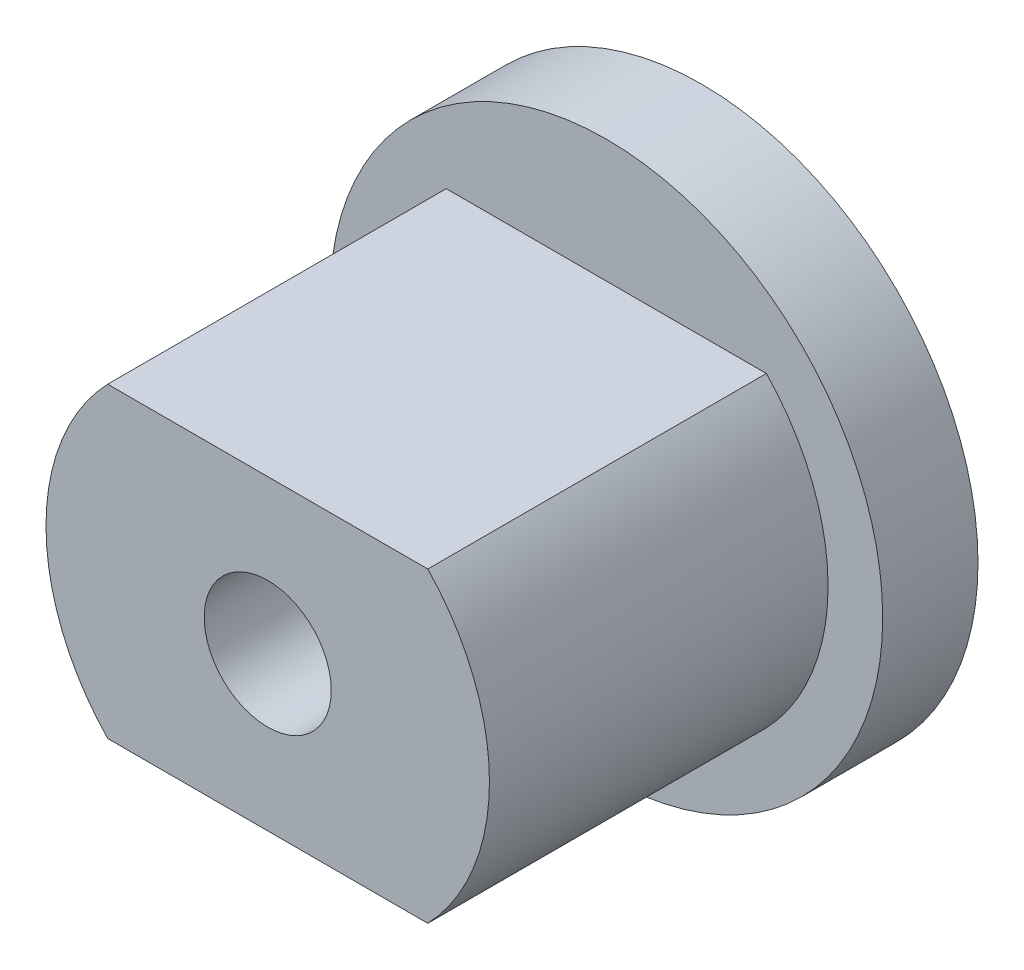
ISO-10303-21;
HEADER;
FILE_DESCRIPTION(('STEP AP214'),'2;1');
FILE_NAME('part.step','',(''),(''),'','','');
FILE_SCHEMA(('AUTOMOTIVE_DESIGN { 1 0 10303 214 1 1 1 1 }'));
ENDSEC;
DATA;
#1=APPLICATION_CONTEXT('core data for automotive mechanical design processes');
#2=APPLICATION_PROTOCOL_DEFINITION('international standard','automotive_design',2000,#1);
#3=PRODUCT_CONTEXT('',#1,'mechanical');
#4=PRODUCT('Part','Part','',(#3));
#5=PRODUCT_RELATED_PRODUCT_CATEGORY('part','',(#4));
#6=PRODUCT_DEFINITION_FORMATION('','',#4);
#7=PRODUCT_DEFINITION_CONTEXT('part definition',#1,'design');
#8=PRODUCT_DEFINITION('design','',#6,#7);
#9=PRODUCT_DEFINITION_SHAPE('','',#8);
#10=(LENGTH_UNIT() NAMED_UNIT(*) SI_UNIT(.MILLI.,.METRE.));
#11=(NAMED_UNIT(*) PLANE_ANGLE_UNIT() SI_UNIT($,.RADIAN.));
#12=(NAMED_UNIT(*) SI_UNIT($,.STERADIAN.) SOLID_ANGLE_UNIT());
#13=UNCERTAINTY_MEASURE_WITH_UNIT(LENGTH_MEASURE(1.E-05),#10,'distance_accuracy_value','');
#14=(GEOMETRIC_REPRESENTATION_CONTEXT(3) GLOBAL_UNCERTAINTY_ASSIGNED_CONTEXT((#13)) GLOBAL_UNIT_ASSIGNED_CONTEXT((#10,
#11,#12)) REPRESENTATION_CONTEXT('',''));
#15=CARTESIAN_POINT('',(0.,0.,0.));
#16=DIRECTION('',(0.,0.,1.));
#17=DIRECTION('',(1.,0.,0.));
#18=AXIS2_PLACEMENT_3D('',#15,#16,#17);
#19=CARTESIAN_POINT('',(0.,0.,5.33));
#20=DIRECTION('',(0.,0.,-1.));
#21=DIRECTION('',(-1.,0.,0.));
#22=AXIS2_PLACEMENT_3D('',#19,#20,#21);
#23=CYLINDRICAL_SURFACE('',#22,3.49);
#24=CARTESIAN_POINT('',(0.,0.,0.));
#25=DIRECTION('',(0.,0.,1.));
#26=DIRECTION('',(1.,0.,0.));
#27=AXIS2_PLACEMENT_3D('',#24,#25,#26);
#28=CIRCLE('',#27,3.49);
#29=CARTESIAN_POINT('',(-2.5194989581264,2.415,0.));
#30=VERTEX_POINT('',#29);
#31=CARTESIAN_POINT('',(-2.5194989581264,-2.415,0.));
#32=VERTEX_POINT('',#31);
#33=EDGE_CURVE('E74',#30,#32,#28,.T.);
#34=ORIENTED_EDGE('',*,*,#33,.T.);
#35=DIRECTION('',(0.,0.,-1.));
#36=VECTOR('',#35,1.);
#37=CARTESIAN_POINT('',(-2.5194989581264,-2.415,5.33));
#38=LINE('',#37,#36);
#39=CARTESIAN_POINT('',(-2.5194989581264,-2.415,5.33));
#40=VERTEX_POINT('',#39);
#41=EDGE_CURVE('E11',#40,#32,#38,.T.);
#42=ORIENTED_EDGE('',*,*,#41,.F.);
#43=CARTESIAN_POINT('',(0.,0.,5.33));
#44=DIRECTION('',(0.,0.,1.));
#45=DIRECTION('',(1.,0.,0.));
#46=AXIS2_PLACEMENT_3D('',#43,#44,#45);
#47=CIRCLE('',#46,3.49);
#48=CARTESIAN_POINT('',(-2.5194989581264,2.415,5.33));
#49=VERTEX_POINT('',#48);
#50=EDGE_CURVE('E78',#49,#40,#47,.T.);
#51=ORIENTED_EDGE('',*,*,#50,.F.);
#52=DIRECTION('',(0.,0.,-1.));
#53=VECTOR('',#52,1.);
#54=CARTESIAN_POINT('',(-2.5194989581264,2.415,5.33));
#55=LINE('',#54,#53);
#56=EDGE_CURVE('E90',#49,#30,#55,.T.);
#57=ORIENTED_EDGE('',*,*,#56,.T.);
#58=EDGE_LOOP('',(#34,#42,#51,#57));
#59=FACE_BOUND('',#58,.T.);
#60=ADVANCED_FACE('F32',(#59),#23,.T.);
#61=CARTESIAN_POINT('',(-2.5194989581264,-2.415,5.33));
#62=DIRECTION('',(0.,1.,0.));
#63=DIRECTION('',(0.,0.,1.));
#64=AXIS2_PLACEMENT_3D('',#61,#62,#63);
#65=PLANE('',#64);
#66=DIRECTION('',(1.,0.,0.));
#67=VECTOR('',#66,1.);
#68=CARTESIAN_POINT('',(-2.5194989581264,-2.415,0.));
#69=LINE('',#68,#67);
#70=CARTESIAN_POINT('',(2.5194989581264,-2.415,0.));
#71=VERTEX_POINT('',#70);
#72=EDGE_CURVE('E87',#32,#71,#69,.T.);
#73=ORIENTED_EDGE('',*,*,#72,.T.);
#74=DIRECTION('',(0.,0.,-1.));
#75=VECTOR('',#74,1.);
#76=CARTESIAN_POINT('',(2.5194989581264,-2.415,5.33));
#77=LINE('',#76,#75);
#78=CARTESIAN_POINT('',(2.5194989581264,-2.415,5.33));
#79=VERTEX_POINT('',#78);
#80=EDGE_CURVE('E40',#79,#71,#77,.T.);
#81=ORIENTED_EDGE('',*,*,#80,.F.);
#82=DIRECTION('',(1.,0.,0.));
#83=VECTOR('',#82,1.);
#84=CARTESIAN_POINT('',(-2.5194989581264,-2.415,5.33));
#85=LINE('',#84,#83);
#86=EDGE_CURVE('E100',#40,#79,#85,.T.);
#87=ORIENTED_EDGE('',*,*,#86,.F.);
#88=ORIENTED_EDGE('',*,*,#41,.T.);
#89=EDGE_LOOP('',(#73,#81,#87,#88));
#90=FACE_BOUND('',#89,.T.);
#91=ADVANCED_FACE('F134',(#90),#65,.F.);
#92=CARTESIAN_POINT('',(0.,0.,5.33));
#93=DIRECTION('',(0.,0.,-1.));
#94=DIRECTION('',(-1.,0.,0.));
#95=AXIS2_PLACEMENT_3D('',#92,#93,#94);
#96=CYLINDRICAL_SURFACE('',#95,3.49);
#97=CARTESIAN_POINT('',(0.,0.,0.));
#98=DIRECTION('',(0.,0.,1.));
#99=DIRECTION('',(1.,0.,0.));
#100=AXIS2_PLACEMENT_3D('',#97,#98,#99);
#101=CIRCLE('',#100,3.49);
#102=CARTESIAN_POINT('',(2.5194989581264,2.415,0.));
#103=VERTEX_POINT('',#102);
#104=EDGE_CURVE('E71',#71,#103,#101,.T.);
#105=ORIENTED_EDGE('',*,*,#104,.T.);
#106=DIRECTION('',(0.,0.,-1.));
#107=VECTOR('',#106,1.);
#108=CARTESIAN_POINT('',(2.5194989581264,2.415,5.33));
#109=LINE('',#108,#107);
#110=CARTESIAN_POINT('',(2.5194989581264,2.415,5.33));
#111=VERTEX_POINT('',#110);
#112=EDGE_CURVE('E85',#111,#103,#109,.T.);
#113=ORIENTED_EDGE('',*,*,#112,.F.);
#114=CARTESIAN_POINT('',(0.,0.,5.33));
#115=DIRECTION('',(0.,0.,1.));
#116=DIRECTION('',(1.,0.,0.));
#117=AXIS2_PLACEMENT_3D('',#114,#115,#116);
#118=CIRCLE('',#117,3.49);
#119=EDGE_CURVE('E98',#79,#111,#118,.T.);
#120=ORIENTED_EDGE('',*,*,#119,.F.);
#121=ORIENTED_EDGE('',*,*,#80,.T.);
#122=EDGE_LOOP('',(#105,#113,#120,#121));
#123=FACE_BOUND('',#122,.T.);
#124=ADVANCED_FACE('F83',(#123),#96,.T.);
#125=CARTESIAN_POINT('',(-2.5194989581264,2.415,5.33));
#126=DIRECTION('',(0.,-1.,0.));
#127=DIRECTION('',(1.,0.,0.));
#128=AXIS2_PLACEMENT_3D('',#125,#126,#127);
#129=PLANE('',#128);
#130=DIRECTION('',(-1.,0.,0.));
#131=VECTOR('',#130,1.);
#132=CARTESIAN_POINT('',(-2.5194989581264,2.415,0.));
#133=LINE('',#132,#131);
#134=EDGE_CURVE('E68',#103,#30,#133,.T.);
#135=ORIENTED_EDGE('',*,*,#134,.T.);
#136=ORIENTED_EDGE('',*,*,#56,.F.);
#137=DIRECTION('',(-1.,0.,0.));
#138=VECTOR('',#137,1.);
#139=CARTESIAN_POINT('',(-2.5194989581264,2.415,5.33));
#140=LINE('',#139,#138);
#141=EDGE_CURVE('E47',#111,#49,#140,.T.);
#142=ORIENTED_EDGE('',*,*,#141,.F.);
#143=ORIENTED_EDGE('',*,*,#112,.T.);
#144=EDGE_LOOP('',(#135,#136,#142,#143));
#145=FACE_BOUND('',#144,.T.);
#146=ADVANCED_FACE('F89',(#145),#129,.F.);
#147=CARTESIAN_POINT('',(0.,0.,5.33));
#148=DIRECTION('',(0.,0.,1.));
#149=DIRECTION('',(1.,0.,0.));
#150=AXIS2_PLACEMENT_3D('',#147,#148,#149);
#151=PLANE('',#150);
#152=CARTESIAN_POINT('',(0.,0.,5.33));
#153=DIRECTION('',(0.,0.,1.));
#154=DIRECTION('',(1.,0.,0.));
#155=AXIS2_PLACEMENT_3D('',#152,#153,#154);
#156=CIRCLE('',#155,1.);
#157=CARTESIAN_POINT('',(1.,0.,5.33));
#158=VERTEX_POINT('',#157);
#159=EDGE_CURVE('E103',#158,#158,#156,.T.);
#160=ORIENTED_EDGE('',*,*,#159,.F.);
#161=EDGE_LOOP('',(#160));
#162=FACE_BOUND('',#161,.T.);
#163=ORIENTED_EDGE('',*,*,#50,.T.);
#164=ORIENTED_EDGE('',*,*,#86,.T.);
#165=ORIENTED_EDGE('',*,*,#119,.T.);
#166=ORIENTED_EDGE('',*,*,#141,.T.);
#167=EDGE_LOOP('',(#163,#164,#165,#166));
#168=FACE_BOUND('',#167,.T.);
#169=ADVANCED_FACE('F142',(#162,#168),#151,.T.);
#170=CARTESIAN_POINT('',(0.,0.,2.33));
#171=DIRECTION('',(0.,0.,1.));
#172=DIRECTION('',(1.,0.,0.));
#173=AXIS2_PLACEMENT_3D('',#170,#171,#172);
#174=CYLINDRICAL_SURFACE('',#173,1.);
#175=CARTESIAN_POINT('',(0.,0.,2.33));
#176=DIRECTION('',(0.,0.,1.));
#177=DIRECTION('',(1.,0.,0.));
#178=AXIS2_PLACEMENT_3D('',#175,#176,#177);
#179=CIRCLE('',#178,1.);
#180=CARTESIAN_POINT('',(1.,0.,2.33));
#181=VERTEX_POINT('',#180);
#182=EDGE_CURVE('E96',#181,#181,#179,.T.);
#183=ORIENTED_EDGE('',*,*,#182,.F.);
#184=EDGE_LOOP('',(#183));
#185=FACE_BOUND('',#184,.T.);
#186=ORIENTED_EDGE('',*,*,#159,.T.);
#187=EDGE_LOOP('',(#186));
#188=FACE_BOUND('',#187,.T.);
#189=ADVANCED_FACE('F129',(#185,#188),#174,.F.);
#190=CARTESIAN_POINT('',(0.,0.,2.33));
#191=DIRECTION('',(0.,0.,1.));
#192=DIRECTION('',(1.,0.,0.));
#193=AXIS2_PLACEMENT_3D('',#190,#191,#192);
#194=PLANE('',#193);
#195=ORIENTED_EDGE('',*,*,#182,.T.);
#196=EDGE_LOOP('',(#195));
#197=FACE_BOUND('',#196,.T.);
#198=ADVANCED_FACE('F124',(#197),#194,.T.);
#199=CARTESIAN_POINT('',(0.,0.,0.));
#200=DIRECTION('',(0.,0.,-1.));
#201=DIRECTION('',(-1.,0.,0.));
#202=AXIS2_PLACEMENT_3D('',#199,#200,#201);
#203=PLANE('',#202);
#204=CARTESIAN_POINT('',(0.,0.,0.));
#205=DIRECTION('',(0.,0.,-1.));
#206=DIRECTION('',(-1.,0.,0.));
#207=AXIS2_PLACEMENT_3D('',#204,#205,#206);
#208=CIRCLE('',#207,4.35);
#209=CARTESIAN_POINT('',(-4.35,0.,0.));
#210=VERTEX_POINT('',#209);
#211=EDGE_CURVE('E109',#210,#210,#208,.T.);
#212=ORIENTED_EDGE('',*,*,#211,.F.);
#213=EDGE_LOOP('',(#212));
#214=FACE_BOUND('',#213,.T.);
#215=ORIENTED_EDGE('',*,*,#72,.F.);
#216=ORIENTED_EDGE('',*,*,#33,.F.);
#217=ORIENTED_EDGE('',*,*,#134,.F.);
#218=ORIENTED_EDGE('',*,*,#104,.F.);
#219=EDGE_LOOP('',(#215,#216,#217,#218));
#220=FACE_BOUND('',#219,.T.);
#221=ADVANCED_FACE('F70',(#214,#220),#203,.F.);
#222=CARTESIAN_POINT('',(0.,0.,-1.5));
#223=DIRECTION('',(0.,0.,1.));
#224=DIRECTION('',(1.,0.,0.));
#225=AXIS2_PLACEMENT_3D('',#222,#223,#224);
#226=CYLINDRICAL_SURFACE('',#225,4.35);
#227=CARTESIAN_POINT('',(0.,0.,-1.5));
#228=DIRECTION('',(0.,0.,-1.));
#229=DIRECTION('',(-1.,0.,0.));
#230=AXIS2_PLACEMENT_3D('',#227,#228,#229);
#231=CIRCLE('',#230,4.35);
#232=CARTESIAN_POINT('',(-4.35,0.,-1.5));
#233=VERTEX_POINT('',#232);
#234=EDGE_CURVE('E106',#233,#233,#231,.T.);
#235=ORIENTED_EDGE('',*,*,#234,.F.);
#236=EDGE_LOOP('',(#235));
#237=FACE_BOUND('',#236,.T.);
#238=ORIENTED_EDGE('',*,*,#211,.T.);
#239=EDGE_LOOP('',(#238));
#240=FACE_BOUND('',#239,.T.);
#241=ADVANCED_FACE('F117',(#237,#240),#226,.T.);
#242=CARTESIAN_POINT('',(0.,0.,-1.5));
#243=DIRECTION('',(0.,0.,-1.));
#244=DIRECTION('',(-1.,0.,0.));
#245=AXIS2_PLACEMENT_3D('',#242,#243,#244);
#246=PLANE('',#245);
#247=ORIENTED_EDGE('',*,*,#234,.T.);
#248=EDGE_LOOP('',(#247));
#249=FACE_BOUND('',#248,.T.);
#250=ADVANCED_FACE('F115',(#249),#246,.T.);
#251=CLOSED_SHELL('',(#60,#91,#124,#146,#169,#189,#198,#221,#241,#250));
#252=MANIFOLD_SOLID_BREP('B2',#251);
#253=ADVANCED_BREP_SHAPE_REPRESENTATION('',(#18,#252),#14);
#254=SHAPE_DEFINITION_REPRESENTATION(#9,#253);
ENDSEC;
END-ISO-10303-21;
